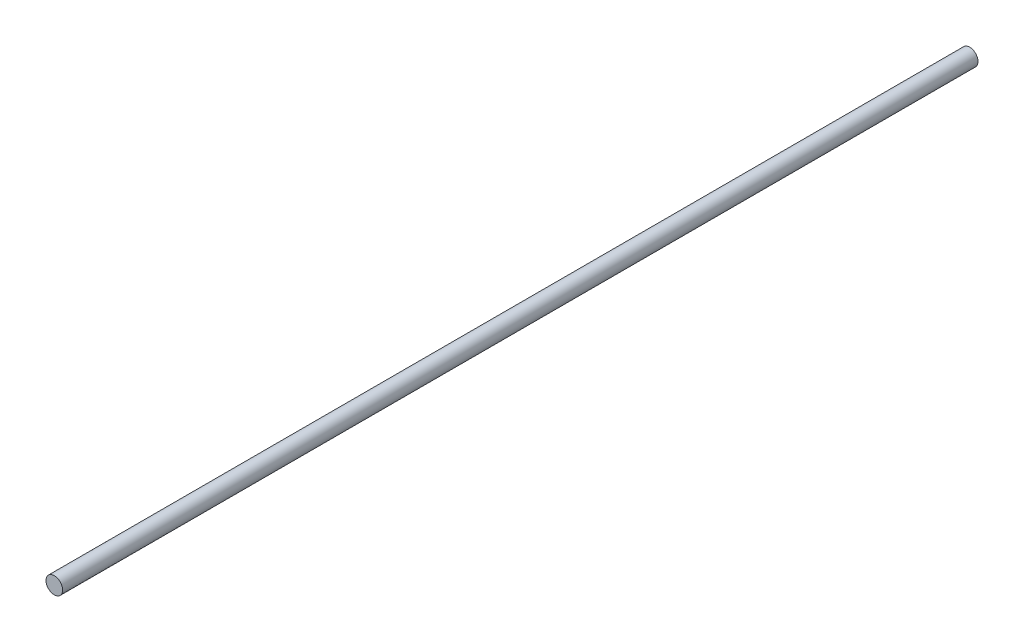
ISO-10303-21;
HEADER;
FILE_DESCRIPTION(('STEP AP214'),'2;1');
FILE_NAME('part.step','',(''),(''),'','','');
FILE_SCHEMA(('AUTOMOTIVE_DESIGN { 1 0 10303 214 1 1 1 1 }'));
ENDSEC;
DATA;
#1=APPLICATION_CONTEXT('core data for automotive mechanical design processes');
#2=APPLICATION_PROTOCOL_DEFINITION('international standard','automotive_design',2000,#1);
#3=PRODUCT_CONTEXT('',#1,'mechanical');
#4=PRODUCT('Part','Part','',(#3));
#5=PRODUCT_RELATED_PRODUCT_CATEGORY('part','',(#4));
#6=PRODUCT_DEFINITION_FORMATION('','',#4);
#7=PRODUCT_DEFINITION_CONTEXT('part definition',#1,'design');
#8=PRODUCT_DEFINITION('design','',#6,#7);
#9=PRODUCT_DEFINITION_SHAPE('','',#8);
#10=(LENGTH_UNIT() NAMED_UNIT(*) SI_UNIT(.MILLI.,.METRE.));
#11=(NAMED_UNIT(*) PLANE_ANGLE_UNIT() SI_UNIT($,.RADIAN.));
#12=(NAMED_UNIT(*) SI_UNIT($,.STERADIAN.) SOLID_ANGLE_UNIT());
#13=UNCERTAINTY_MEASURE_WITH_UNIT(LENGTH_MEASURE(1.E-05),#10,'distance_accuracy_value','');
#14=(GEOMETRIC_REPRESENTATION_CONTEXT(3) GLOBAL_UNCERTAINTY_ASSIGNED_CONTEXT((#13)) GLOBAL_UNIT_ASSIGNED_CONTEXT((#10,
#11,#12)) REPRESENTATION_CONTEXT('',''));
#15=CARTESIAN_POINT('',(0.,0.,0.));
#16=DIRECTION('',(0.,0.,1.));
#17=DIRECTION('',(1.,0.,0.));
#18=AXIS2_PLACEMENT_3D('',#15,#16,#17);
#19=CARTESIAN_POINT('',(0.,0.,349.425999902));
#20=DIRECTION('',(0.,0.,-1.));
#21=DIRECTION('',(-1.,0.,0.));
#22=AXIS2_PLACEMENT_3D('',#19,#20,#21);
#23=CYLINDRICAL_SURFACE('',#22,3.175);
#24=CARTESIAN_POINT('',(0.,0.,349.425999902));
#25=DIRECTION('',(0.,0.,1.));
#26=DIRECTION('',(1.,0.,0.));
#27=AXIS2_PLACEMENT_3D('',#24,#25,#26);
#28=CIRCLE('',#27,3.175);
#29=CARTESIAN_POINT('',(3.175,0.,349.425999902));
#30=VERTEX_POINT('',#29);
#31=EDGE_CURVE('E10',#30,#30,#28,.T.);
#32=ORIENTED_EDGE('',*,*,#31,.F.);
#33=EDGE_LOOP('',(#32));
#34=FACE_BOUND('',#33,.T.);
#35=CARTESIAN_POINT('',(0.,0.,0.));
#36=DIRECTION('',(0.,0.,1.));
#37=DIRECTION('',(1.,0.,0.));
#38=AXIS2_PLACEMENT_3D('',#35,#36,#37);
#39=CIRCLE('',#38,3.175);
#40=CARTESIAN_POINT('',(3.175,0.,0.));
#41=VERTEX_POINT('',#40);
#42=EDGE_CURVE('E35',#41,#41,#39,.T.);
#43=ORIENTED_EDGE('',*,*,#42,.T.);
#44=EDGE_LOOP('',(#43));
#45=FACE_BOUND('',#44,.T.);
#46=ADVANCED_FACE('F32',(#34,#45),#23,.T.);
#47=CARTESIAN_POINT('',(0.,0.,349.425999902));
#48=DIRECTION('',(0.,0.,1.));
#49=DIRECTION('',(1.,0.,0.));
#50=AXIS2_PLACEMENT_3D('',#47,#48,#49);
#51=PLANE('',#50);
#52=ORIENTED_EDGE('',*,*,#31,.T.);
#53=EDGE_LOOP('',(#52));
#54=FACE_BOUND('',#53,.T.);
#55=ADVANCED_FACE('F47',(#54),#51,.T.);
#56=CARTESIAN_POINT('',(0.,0.,0.));
#57=DIRECTION('',(0.,0.,1.));
#58=DIRECTION('',(1.,0.,0.));
#59=AXIS2_PLACEMENT_3D('',#56,#57,#58);
#60=PLANE('',#59);
#61=ORIENTED_EDGE('',*,*,#42,.F.);
#62=EDGE_LOOP('',(#61));
#63=FACE_BOUND('',#62,.T.);
#64=ADVANCED_FACE('F45',(#63),#60,.F.);
#65=CLOSED_SHELL('',(#46,#55,#64));
#66=MANIFOLD_SOLID_BREP('B2',#65);
#67=ADVANCED_BREP_SHAPE_REPRESENTATION('',(#18,#66),#14);
#68=SHAPE_DEFINITION_REPRESENTATION(#9,#67);
ENDSEC;
END-ISO-10303-21;
